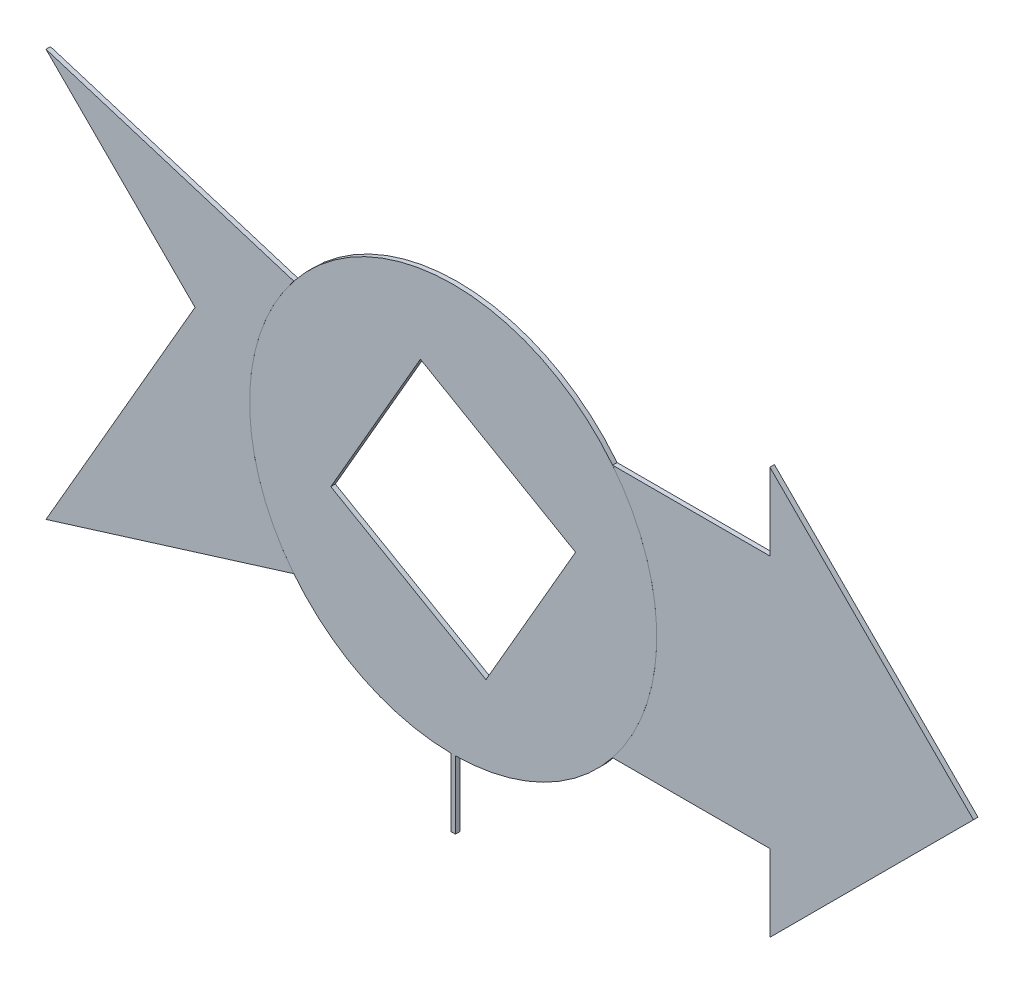
ISO-10303-21;
HEADER;
FILE_DESCRIPTION(('STEP AP214'),'2;1');
FILE_NAME('part.step','',(''),(''),'','','');
FILE_SCHEMA(('AUTOMOTIVE_DESIGN { 1 0 10303 214 1 1 1 1 }'));
ENDSEC;
DATA;
#1=APPLICATION_CONTEXT('core data for automotive mechanical design processes');
#2=APPLICATION_PROTOCOL_DEFINITION('international standard','automotive_design',2000,#1);
#3=PRODUCT_CONTEXT('',#1,'mechanical');
#4=PRODUCT('Part','Part','',(#3));
#5=PRODUCT_RELATED_PRODUCT_CATEGORY('part','',(#4));
#6=PRODUCT_DEFINITION_FORMATION('','',#4);
#7=PRODUCT_DEFINITION_CONTEXT('part definition',#1,'design');
#8=PRODUCT_DEFINITION('design','',#6,#7);
#9=PRODUCT_DEFINITION_SHAPE('','',#8);
#10=(LENGTH_UNIT() NAMED_UNIT(*) SI_UNIT(.MILLI.,.METRE.));
#11=(NAMED_UNIT(*) PLANE_ANGLE_UNIT() SI_UNIT($,.RADIAN.));
#12=(NAMED_UNIT(*) SI_UNIT($,.STERADIAN.) SOLID_ANGLE_UNIT());
#13=UNCERTAINTY_MEASURE_WITH_UNIT(LENGTH_MEASURE(1.E-05),#10,'distance_accuracy_value','');
#14=(GEOMETRIC_REPRESENTATION_CONTEXT(3) GLOBAL_UNCERTAINTY_ASSIGNED_CONTEXT((#13)) GLOBAL_UNIT_ASSIGNED_CONTEXT((#10,
#11,#12)) REPRESENTATION_CONTEXT('',''));
#15=CARTESIAN_POINT('',(0.,0.,0.));
#16=DIRECTION('',(0.,0.,1.));
#17=DIRECTION('',(1.,0.,0.));
#18=AXIS2_PLACEMENT_3D('',#15,#16,#17);
#19=CARTESIAN_POINT('',(160.,105.,1.));
#20=DIRECTION('',(0.707106781186547,0.707106781186548,0.));
#21=DIRECTION('',(-0.707106781186548,0.707106781186547,0.));
#22=AXIS2_PLACEMENT_3D('',#19,#20,#21);
#23=PLANE('',#22);
#24=DIRECTION('',(0.707106781186548,-0.707106781186547,0.));
#25=VECTOR('',#24,1.);
#26=CARTESIAN_POINT('',(160.,105.,0.));
#27=LINE('',#26,#25);
#28=CARTESIAN_POINT('',(160.,105.,0.));
#29=VERTEX_POINT('',#28);
#30=CARTESIAN_POINT('',(205.,60.,0.));
#31=VERTEX_POINT('',#30);
#32=EDGE_CURVE('E139',#29,#31,#27,.T.);
#33=ORIENTED_EDGE('',*,*,#32,.F.);
#34=DIRECTION('',(0.,0.,-1.));
#35=VECTOR('',#34,1.);
#36=CARTESIAN_POINT('',(160.,105.,1.));
#37=LINE('',#36,#35);
#38=CARTESIAN_POINT('',(160.,105.,1.));
#39=VERTEX_POINT('',#38);
#40=EDGE_CURVE('E12',#39,#29,#37,.T.);
#41=ORIENTED_EDGE('',*,*,#40,.F.);
#42=DIRECTION('',(0.707106781186548,-0.707106781186547,0.));
#43=VECTOR('',#42,1.);
#44=CARTESIAN_POINT('',(160.,105.,1.));
#45=LINE('',#44,#43);
#46=CARTESIAN_POINT('',(205.,60.,1.));
#47=VERTEX_POINT('',#46);
#48=EDGE_CURVE('E154',#39,#47,#45,.T.);
#49=ORIENTED_EDGE('',*,*,#48,.T.);
#50=DIRECTION('',(0.,0.,-1.));
#51=VECTOR('',#50,1.);
#52=CARTESIAN_POINT('',(205.,60.,1.));
#53=LINE('',#52,#51);
#54=EDGE_CURVE('E49',#47,#31,#53,.T.);
#55=ORIENTED_EDGE('',*,*,#54,.T.);
#56=EDGE_LOOP('',(#33,#41,#49,#55));
#57=FACE_BOUND('',#56,.T.);
#58=ADVANCED_FACE('F46',(#57),#23,.T.);
#59=CARTESIAN_POINT('',(160.,105.,1.));
#60=DIRECTION('',(1.,0.,0.));
#61=DIRECTION('',(0.,0.,-1.));
#62=AXIS2_PLACEMENT_3D('',#59,#60,#61);
#63=PLANE('',#62);
#64=DIRECTION('',(0.,-1.,0.));
#65=VECTOR('',#64,1.);
#66=CARTESIAN_POINT('',(160.,105.,0.));
#67=LINE('',#66,#65);
#68=CARTESIAN_POINT('',(160.,88.,0.));
#69=VERTEX_POINT('',#68);
#70=EDGE_CURVE('E88',#29,#69,#67,.T.);
#71=ORIENTED_EDGE('',*,*,#70,.T.);
#72=DIRECTION('',(0.,0.,-1.));
#73=VECTOR('',#72,1.);
#74=CARTESIAN_POINT('',(160.,88.,1.));
#75=LINE('',#74,#73);
#76=CARTESIAN_POINT('',(160.,88.,1.));
#77=VERTEX_POINT('',#76);
#78=EDGE_CURVE('E55',#77,#69,#75,.T.);
#79=ORIENTED_EDGE('',*,*,#78,.F.);
#80=DIRECTION('',(0.,-1.,0.));
#81=VECTOR('',#80,1.);
#82=CARTESIAN_POINT('',(160.,105.,1.));
#83=LINE('',#82,#81);
#84=EDGE_CURVE('E118',#39,#77,#83,.T.);
#85=ORIENTED_EDGE('',*,*,#84,.F.);
#86=ORIENTED_EDGE('',*,*,#40,.T.);
#87=EDGE_LOOP('',(#71,#79,#85,#86));
#88=FACE_BOUND('',#87,.T.);
#89=ADVANCED_FACE('F182',(#88),#63,.F.);
#90=CARTESIAN_POINT('',(160.,88.,1.));
#91=DIRECTION('',(0.,-1.,0.));
#92=DIRECTION('',(0.,0.,-1.));
#93=AXIS2_PLACEMENT_3D('',#90,#91,#92);
#94=PLANE('',#93);
#95=DIRECTION('',(-1.,0.,0.));
#96=VECTOR('',#95,1.);
#97=CARTESIAN_POINT('',(160.,88.,0.));
#98=LINE('',#97,#96);
#99=CARTESIAN_POINT('',(125.227829907617,88.,0.));
#100=VERTEX_POINT('',#99);
#101=EDGE_CURVE('E125',#69,#100,#98,.T.);
#102=ORIENTED_EDGE('',*,*,#101,.T.);
#103=DIRECTION('',(0.,0.,-1.));
#104=VECTOR('',#103,1.);
#105=CARTESIAN_POINT('',(125.227829907617,88.,1.));
#106=LINE('',#105,#104);
#107=CARTESIAN_POINT('',(125.227829907617,88.,1.));
#108=VERTEX_POINT('',#107);
#109=EDGE_CURVE('E122',#108,#100,#106,.T.);
#110=ORIENTED_EDGE('',*,*,#109,.F.);
#111=DIRECTION('',(-1.,0.,0.));
#112=VECTOR('',#111,1.);
#113=CARTESIAN_POINT('',(160.,88.,1.));
#114=LINE('',#113,#112);
#115=EDGE_CURVE('E110',#77,#108,#114,.T.);
#116=ORIENTED_EDGE('',*,*,#115,.F.);
#117=ORIENTED_EDGE('',*,*,#78,.T.);
#118=EDGE_LOOP('',(#102,#110,#116,#117));
#119=FACE_BOUND('',#118,.T.);
#120=ADVANCED_FACE('F123',(#119),#94,.F.);
#121=CARTESIAN_POINT('',(90.,60.,1.));
#122=DIRECTION('',(0.,0.,-1.));
#123=DIRECTION('',(-1.,0.,0.));
#124=AXIS2_PLACEMENT_3D('',#121,#122,#123);
#125=CYLINDRICAL_SURFACE('',#124,45.);
#126=CARTESIAN_POINT('',(90.,60.,0.));
#127=DIRECTION('',(0.,0.,1.));
#128=DIRECTION('',(1.,0.,0.));
#129=AXIS2_PLACEMENT_3D('',#126,#127,#128);
#130=CIRCLE('',#129,45.);
#131=CARTESIAN_POINT('',(125.227829907617,32.,0.));
#132=VERTEX_POINT('',#131);
#133=EDGE_CURVE('E151',#132,#100,#130,.T.);
#134=ORIENTED_EDGE('',*,*,#133,.F.);
#135=DIRECTION('',(0.,0.,-1.));
#136=VECTOR('',#135,1.);
#137=CARTESIAN_POINT('',(125.227829907617,32.,1.));
#138=LINE('',#137,#136);
#139=CARTESIAN_POINT('',(125.227829907617,32.,1.));
#140=VERTEX_POINT('',#139);
#141=EDGE_CURVE('E129',#140,#132,#138,.T.);
#142=ORIENTED_EDGE('',*,*,#141,.F.);
#143=CARTESIAN_POINT('',(90.,60.,1.));
#144=DIRECTION('',(0.,0.,1.));
#145=DIRECTION('',(1.,0.,0.));
#146=AXIS2_PLACEMENT_3D('',#143,#144,#145);
#147=CIRCLE('',#146,45.);
#148=EDGE_CURVE('E116',#140,#108,#147,.T.);
#149=ORIENTED_EDGE('',*,*,#148,.T.);
#150=ORIENTED_EDGE('',*,*,#109,.T.);
#151=EDGE_LOOP('',(#134,#142,#149,#150));
#152=FACE_BOUND('',#151,.T.);
#153=ADVANCED_FACE('F131',(#152),#125,.F.);
#154=CARTESIAN_POINT('',(160.,32.,1.));
#155=DIRECTION('',(0.,-1.,0.));
#156=DIRECTION('',(0.,0.,-1.));
#157=AXIS2_PLACEMENT_3D('',#154,#155,#156);
#158=PLANE('',#157);
#159=DIRECTION('',(-1.,0.,0.));
#160=VECTOR('',#159,1.);
#161=CARTESIAN_POINT('',(160.,32.,0.));
#162=LINE('',#161,#160);
#163=CARTESIAN_POINT('',(160.,32.,0.));
#164=VERTEX_POINT('',#163);
#165=EDGE_CURVE('E148',#164,#132,#162,.T.);
#166=ORIENTED_EDGE('',*,*,#165,.F.);
#167=DIRECTION('',(0.,0.,-1.));
#168=VECTOR('',#167,1.);
#169=CARTESIAN_POINT('',(160.,32.,1.));
#170=LINE('',#169,#168);
#171=CARTESIAN_POINT('',(160.,32.,1.));
#172=VERTEX_POINT('',#171);
#173=EDGE_CURVE('E158',#172,#164,#170,.T.);
#174=ORIENTED_EDGE('',*,*,#173,.F.);
#175=DIRECTION('',(-1.,0.,0.));
#176=VECTOR('',#175,1.);
#177=CARTESIAN_POINT('',(160.,32.,1.));
#178=LINE('',#177,#176);
#179=EDGE_CURVE('E132',#172,#140,#178,.T.);
#180=ORIENTED_EDGE('',*,*,#179,.T.);
#181=ORIENTED_EDGE('',*,*,#141,.T.);
#182=EDGE_LOOP('',(#166,#174,#180,#181));
#183=FACE_BOUND('',#182,.T.);
#184=ADVANCED_FACE('F166',(#183),#158,.T.);
#185=CARTESIAN_POINT('',(160.,15.,1.));
#186=DIRECTION('',(-1.,0.,0.));
#187=DIRECTION('',(0.,0.,1.));
#188=AXIS2_PLACEMENT_3D('',#185,#186,#187);
#189=PLANE('',#188);
#190=DIRECTION('',(0.,1.,0.));
#191=VECTOR('',#190,1.);
#192=CARTESIAN_POINT('',(160.,15.,0.));
#193=LINE('',#192,#191);
#194=CARTESIAN_POINT('',(160.,15.,0.));
#195=VERTEX_POINT('',#194);
#196=EDGE_CURVE('E145',#195,#164,#193,.T.);
#197=ORIENTED_EDGE('',*,*,#196,.F.);
#198=DIRECTION('',(0.,0.,-1.));
#199=VECTOR('',#198,1.);
#200=CARTESIAN_POINT('',(160.,15.,1.));
#201=LINE('',#200,#199);
#202=CARTESIAN_POINT('',(160.,15.,1.));
#203=VERTEX_POINT('',#202);
#204=EDGE_CURVE('E159',#203,#195,#201,.T.);
#205=ORIENTED_EDGE('',*,*,#204,.F.);
#206=DIRECTION('',(0.,1.,0.));
#207=VECTOR('',#206,1.);
#208=CARTESIAN_POINT('',(160.,15.,1.));
#209=LINE('',#208,#207);
#210=EDGE_CURVE('E134',#203,#172,#209,.T.);
#211=ORIENTED_EDGE('',*,*,#210,.T.);
#212=ORIENTED_EDGE('',*,*,#173,.T.);
#213=EDGE_LOOP('',(#197,#205,#211,#212));
#214=FACE_BOUND('',#213,.T.);
#215=ADVANCED_FACE('F170',(#214),#189,.T.);
#216=CARTESIAN_POINT('',(205.,60.,1.));
#217=DIRECTION('',(0.707106781186547,-0.707106781186548,0.));
#218=DIRECTION('',(0.707106781186548,0.707106781186547,0.));
#219=AXIS2_PLACEMENT_3D('',#216,#217,#218);
#220=PLANE('',#219);
#221=DIRECTION('',(-0.707106781186548,-0.707106781186547,0.));
#222=VECTOR('',#221,1.);
#223=CARTESIAN_POINT('',(205.,60.,0.));
#224=LINE('',#223,#222);
#225=EDGE_CURVE('E142',#31,#195,#224,.T.);
#226=ORIENTED_EDGE('',*,*,#225,.F.);
#227=ORIENTED_EDGE('',*,*,#54,.F.);
#228=DIRECTION('',(-0.707106781186548,-0.707106781186547,0.));
#229=VECTOR('',#228,1.);
#230=CARTESIAN_POINT('',(205.,60.,1.));
#231=LINE('',#230,#229);
#232=EDGE_CURVE('E171',#47,#203,#231,.T.);
#233=ORIENTED_EDGE('',*,*,#232,.T.);
#234=ORIENTED_EDGE('',*,*,#204,.T.);
#235=EDGE_LOOP('',(#226,#227,#233,#234));
#236=FACE_BOUND('',#235,.T.);
#237=ADVANCED_FACE('F161',(#236),#220,.T.);
#238=CARTESIAN_POINT('',(90.,60.,1.));
#239=DIRECTION('',(0.,0.,1.));
#240=DIRECTION('',(1.,0.,0.));
#241=AXIS2_PLACEMENT_3D('',#238,#239,#240);
#242=PLANE('',#241);
#243=ORIENTED_EDGE('',*,*,#48,.F.);
#244=ORIENTED_EDGE('',*,*,#84,.T.);
#245=ORIENTED_EDGE('',*,*,#115,.T.);
#246=ORIENTED_EDGE('',*,*,#148,.F.);
#247=ORIENTED_EDGE('',*,*,#179,.F.);
#248=ORIENTED_EDGE('',*,*,#210,.F.);
#249=ORIENTED_EDGE('',*,*,#232,.F.);
#250=EDGE_LOOP('',(#243,#244,#245,#246,#247,#248,#249));
#251=FACE_BOUND('',#250,.T.);
#252=ADVANCED_FACE('F113',(#251),#242,.T.);
#253=CARTESIAN_POINT('',(90.,60.,0.));
#254=DIRECTION('',(0.,0.,1.));
#255=DIRECTION('',(1.,0.,0.));
#256=AXIS2_PLACEMENT_3D('',#253,#254,#255);
#257=PLANE('',#256);
#258=ORIENTED_EDGE('',*,*,#32,.T.);
#259=ORIENTED_EDGE('',*,*,#225,.T.);
#260=ORIENTED_EDGE('',*,*,#196,.T.);
#261=ORIENTED_EDGE('',*,*,#165,.T.);
#262=ORIENTED_EDGE('',*,*,#133,.T.);
#263=ORIENTED_EDGE('',*,*,#101,.F.);
#264=ORIENTED_EDGE('',*,*,#70,.F.);
#265=EDGE_LOOP('',(#258,#259,#260,#261,#262,#263,#264));
#266=FACE_BOUND('',#265,.T.);
#267=ADVANCED_FACE('F163',(#266),#257,.F.);
#268=CLOSED_SHELL('',(#58,#89,#120,#153,#184,#215,#237,#252,#267));
#269=MANIFOLD_SOLID_BREP('B2',#268);
#270=CARTESIAN_POINT('',(0.,15.,1.));
#271=DIRECTION('',(0.866025403784438,-0.500000000000001,0.));
#272=DIRECTION('',(0.500000000000001,0.866025403784438,0.));
#273=AXIS2_PLACEMENT_3D('',#270,#271,#272);
#274=PLANE('',#273);
#275=DIRECTION('',(-0.500000000000001,-0.866025403784438,0.));
#276=VECTOR('',#275,1.);
#277=CARTESIAN_POINT('',(0.,15.,0.));
#278=LINE('',#277,#276);
#279=CARTESIAN_POINT('',(32.9422863405996,72.0577136594005,0.));
#280=VERTEX_POINT('',#279);
#281=CARTESIAN_POINT('',(0.,15.,0.));
#282=VERTEX_POINT('',#281);
#283=EDGE_CURVE('E331',#280,#282,#278,.T.);
#284=ORIENTED_EDGE('',*,*,#283,.T.);
#285=DIRECTION('',(0.,0.,-1.));
#286=VECTOR('',#285,1.);
#287=CARTESIAN_POINT('',(0.,15.,1.));
#288=LINE('',#287,#286);
#289=CARTESIAN_POINT('',(0.,15.,1.));
#290=VERTEX_POINT('',#289);
#291=EDGE_CURVE('E44',#290,#282,#288,.T.);
#292=ORIENTED_EDGE('',*,*,#291,.F.);
#293=DIRECTION('',(-0.500000000000001,-0.866025403784438,0.));
#294=VECTOR('',#293,1.);
#295=CARTESIAN_POINT('',(0.,15.,1.));
#296=LINE('',#295,#294);
#297=CARTESIAN_POINT('',(32.9422863405996,72.0577136594005,1.));
#298=VERTEX_POINT('',#297);
#299=EDGE_CURVE('E339',#298,#290,#296,.T.);
#300=ORIENTED_EDGE('',*,*,#299,.F.);
#301=DIRECTION('',(0.,0.,-1.));
#302=VECTOR('',#301,1.);
#303=CARTESIAN_POINT('',(32.9422863405996,72.0577136594005,1.));
#304=LINE('',#303,#302);
#305=EDGE_CURVE('E327',#298,#280,#304,.T.);
#306=ORIENTED_EDGE('',*,*,#305,.T.);
#307=EDGE_LOOP('',(#284,#292,#300,#306));
#308=FACE_BOUND('',#307,.T.);
#309=ADVANCED_FACE('F257',(#308),#274,.F.);
#310=CARTESIAN_POINT('',(0.,15.,1.));
#311=DIRECTION('',(-0.296426894481807,0.955055546147904,0.));
#312=DIRECTION('',(-0.955055546147904,-0.296426894481807,0.));
#313=AXIS2_PLACEMENT_3D('',#310,#311,#312);
#314=PLANE('',#313);
#315=DIRECTION('',(0.955055546147904,0.296426894481807,0.));
#316=VECTOR('',#315,1.);
#317=CARTESIAN_POINT('',(0.,15.,0.));
#318=LINE('',#317,#316);
#319=CARTESIAN_POINT('',(54.7721700923829,32.,0.));
#320=VERTEX_POINT('',#319);
#321=EDGE_CURVE('E334',#282,#320,#318,.T.);
#322=ORIENTED_EDGE('',*,*,#321,.T.);
#323=DIRECTION('',(0.,0.,-1.));
#324=VECTOR('',#323,1.);
#325=CARTESIAN_POINT('',(54.7721700923829,32.,1.));
#326=LINE('',#325,#324);
#327=CARTESIAN_POINT('',(54.7721700923829,32.,1.));
#328=VERTEX_POINT('',#327);
#329=EDGE_CURVE('E265',#328,#320,#326,.T.);
#330=ORIENTED_EDGE('',*,*,#329,.F.);
#331=DIRECTION('',(0.955055546147904,0.296426894481807,0.));
#332=VECTOR('',#331,1.);
#333=CARTESIAN_POINT('',(0.,15.,1.));
#334=LINE('',#333,#332);
#335=EDGE_CURVE('E307',#290,#328,#334,.T.);
#336=ORIENTED_EDGE('',*,*,#335,.F.);
#337=ORIENTED_EDGE('',*,*,#291,.T.);
#338=EDGE_LOOP('',(#322,#330,#336,#337));
#339=FACE_BOUND('',#338,.T.);
#340=ADVANCED_FACE('F358',(#339),#314,.F.);
#341=CARTESIAN_POINT('',(90.,60.,1.));
#342=DIRECTION('',(0.,0.,-1.));
#343=DIRECTION('',(-1.,0.,0.));
#344=AXIS2_PLACEMENT_3D('',#341,#342,#343);
#345=CYLINDRICAL_SURFACE('',#344,45.);
#346=CARTESIAN_POINT('',(90.,60.,0.));
#347=DIRECTION('',(0.,0.,-1.));
#348=DIRECTION('',(1.,0.,0.));
#349=AXIS2_PLACEMENT_3D('',#346,#347,#348);
#350=CIRCLE('',#349,45.);
#351=CARTESIAN_POINT('',(54.7721700923829,88.,0.));
#352=VERTEX_POINT('',#351);
#353=EDGE_CURVE('E322',#320,#352,#350,.T.);
#354=ORIENTED_EDGE('',*,*,#353,.T.);
#355=DIRECTION('',(0.,0.,-1.));
#356=VECTOR('',#355,1.);
#357=CARTESIAN_POINT('',(54.7721700923829,88.,1.));
#358=LINE('',#357,#356);
#359=CARTESIAN_POINT('',(54.7721700923829,88.,1.));
#360=VERTEX_POINT('',#359);
#361=EDGE_CURVE('E319',#360,#352,#358,.T.);
#362=ORIENTED_EDGE('',*,*,#361,.F.);
#363=CARTESIAN_POINT('',(90.,60.,1.));
#364=DIRECTION('',(0.,0.,-1.));
#365=DIRECTION('',(1.,0.,0.));
#366=AXIS2_PLACEMENT_3D('',#363,#364,#365);
#367=CIRCLE('',#366,45.);
#368=EDGE_CURVE('E311',#328,#360,#367,.T.);
#369=ORIENTED_EDGE('',*,*,#368,.F.);
#370=ORIENTED_EDGE('',*,*,#329,.T.);
#371=EDGE_LOOP('',(#354,#362,#369,#370));
#372=FACE_BOUND('',#371,.T.);
#373=ADVANCED_FACE('F320',(#372),#345,.F.);
#374=CARTESIAN_POINT('',(0.,105.,1.));
#375=DIRECTION('',(-0.296426894481807,-0.955055546147904,0.));
#376=DIRECTION('',(0.955055546147904,-0.296426894481807,0.));
#377=AXIS2_PLACEMENT_3D('',#374,#375,#376);
#378=PLANE('',#377);
#379=DIRECTION('',(-0.955055546147904,0.296426894481807,0.));
#380=VECTOR('',#379,1.);
#381=CARTESIAN_POINT('',(0.,105.,0.));
#382=LINE('',#381,#380);
#383=CARTESIAN_POINT('',(0.,105.,0.));
#384=VERTEX_POINT('',#383);
#385=EDGE_CURVE('E293',#352,#384,#382,.T.);
#386=ORIENTED_EDGE('',*,*,#385,.T.);
#387=DIRECTION('',(0.,0.,-1.));
#388=VECTOR('',#387,1.);
#389=CARTESIAN_POINT('',(0.,105.,1.));
#390=LINE('',#389,#388);
#391=CARTESIAN_POINT('',(0.,105.,1.));
#392=VERTEX_POINT('',#391);
#393=EDGE_CURVE('E323',#392,#384,#390,.T.);
#394=ORIENTED_EDGE('',*,*,#393,.F.);
#395=DIRECTION('',(-0.955055546147904,0.296426894481807,0.));
#396=VECTOR('',#395,1.);
#397=CARTESIAN_POINT('',(0.,105.,1.));
#398=LINE('',#397,#396);
#399=EDGE_CURVE('E315',#360,#392,#398,.T.);
#400=ORIENTED_EDGE('',*,*,#399,.F.);
#401=ORIENTED_EDGE('',*,*,#361,.T.);
#402=EDGE_LOOP('',(#386,#394,#400,#401));
#403=FACE_BOUND('',#402,.T.);
#404=ADVANCED_FACE('F325',(#403),#378,.F.);
#405=CARTESIAN_POINT('',(32.9422863405996,72.0577136594005,1.));
#406=DIRECTION('',(0.707106781186546,0.707106781186549,0.));
#407=DIRECTION('',(-0.707106781186549,0.707106781186546,0.));
#408=AXIS2_PLACEMENT_3D('',#405,#406,#407);
#409=PLANE('',#408);
#410=DIRECTION('',(0.707106781186549,-0.707106781186546,0.));
#411=VECTOR('',#410,1.);
#412=CARTESIAN_POINT('',(32.9422863405996,72.0577136594005,0.));
#413=LINE('',#412,#411);
#414=EDGE_CURVE('E299',#384,#280,#413,.T.);
#415=ORIENTED_EDGE('',*,*,#414,.T.);
#416=ORIENTED_EDGE('',*,*,#305,.F.);
#417=DIRECTION('',(0.707106781186549,-0.707106781186546,0.));
#418=VECTOR('',#417,1.);
#419=CARTESIAN_POINT('',(32.9422863405996,72.0577136594005,1.));
#420=LINE('',#419,#418);
#421=EDGE_CURVE('E273',#392,#298,#420,.T.);
#422=ORIENTED_EDGE('',*,*,#421,.F.);
#423=ORIENTED_EDGE('',*,*,#393,.T.);
#424=EDGE_LOOP('',(#415,#416,#422,#423));
#425=FACE_BOUND('',#424,.T.);
#426=ADVANCED_FACE('F347',(#425),#409,.F.);
#427=CARTESIAN_POINT('',(90.,60.,1.));
#428=DIRECTION('',(0.,0.,1.));
#429=DIRECTION('',(1.,0.,0.));
#430=AXIS2_PLACEMENT_3D('',#427,#428,#429);
#431=PLANE('',#430);
#432=ORIENTED_EDGE('',*,*,#299,.T.);
#433=ORIENTED_EDGE('',*,*,#335,.T.);
#434=ORIENTED_EDGE('',*,*,#368,.T.);
#435=ORIENTED_EDGE('',*,*,#399,.T.);
#436=ORIENTED_EDGE('',*,*,#421,.T.);
#437=EDGE_LOOP('',(#432,#433,#434,#435,#436));
#438=FACE_BOUND('',#437,.T.);
#439=ADVANCED_FACE('F313',(#438),#431,.T.);
#440=CARTESIAN_POINT('',(90.,60.,0.));
#441=DIRECTION('',(0.,0.,1.));
#442=DIRECTION('',(1.,0.,0.));
#443=AXIS2_PLACEMENT_3D('',#440,#441,#442);
#444=PLANE('',#443);
#445=ORIENTED_EDGE('',*,*,#283,.F.);
#446=ORIENTED_EDGE('',*,*,#414,.F.);
#447=ORIENTED_EDGE('',*,*,#385,.F.);
#448=ORIENTED_EDGE('',*,*,#353,.F.);
#449=ORIENTED_EDGE('',*,*,#321,.F.);
#450=EDGE_LOOP('',(#445,#446,#447,#448,#449));
#451=FACE_BOUND('',#450,.T.);
#452=ADVANCED_FACE('F343',(#451),#444,.F.);
#453=CLOSED_SHELL('',(#309,#340,#373,#404,#426,#439,#452));
#454=MANIFOLD_SOLID_BREP('B6',#453);
#455=CARTESIAN_POINT('',(90.,60.,1.));
#456=DIRECTION('',(0.,0.,-1.));
#457=DIRECTION('',(-1.,0.,0.));
#458=AXIS2_PLACEMENT_3D('',#455,#456,#457);
#459=CYLINDRICAL_SURFACE('',#458,45.);
#460=CARTESIAN_POINT('',(90.,60.,0.));
#461=DIRECTION('',(0.,0.,1.));
#462=DIRECTION('',(1.,0.,0.));
#463=AXIS2_PLACEMENT_3D('',#460,#461,#462);
#464=CIRCLE('',#463,45.);
#465=CARTESIAN_POINT('',(90.5,15.002777863517,0.));
#466=VERTEX_POINT('',#465);
#467=CARTESIAN_POINT('',(89.5,15.002777863517,0.));
#468=VERTEX_POINT('',#467);
#469=EDGE_CURVE('E506',#466,#468,#464,.T.);
#470=ORIENTED_EDGE('',*,*,#469,.T.);
#471=DIRECTION('',(0.,0.,-1.));
#472=VECTOR('',#471,1.);
#473=CARTESIAN_POINT('',(89.5,15.002777863517,1.));
#474=LINE('',#473,#472);
#475=CARTESIAN_POINT('',(89.5,15.002777863517,1.));
#476=VERTEX_POINT('',#475);
#477=EDGE_CURVE('E255',#476,#468,#474,.T.);
#478=ORIENTED_EDGE('',*,*,#477,.F.);
#479=CARTESIAN_POINT('',(90.,60.,1.));
#480=DIRECTION('',(0.,0.,1.));
#481=DIRECTION('',(1.,0.,0.));
#482=AXIS2_PLACEMENT_3D('',#479,#480,#481);
#483=CIRCLE('',#482,45.);
#484=CARTESIAN_POINT('',(90.5,15.002777863517,1.));
#485=VERTEX_POINT('',#484);
#486=EDGE_CURVE('E510',#485,#476,#483,.T.);
#487=ORIENTED_EDGE('',*,*,#486,.F.);
#488=DIRECTION('',(0.,0.,-1.));
#489=VECTOR('',#488,1.);
#490=CARTESIAN_POINT('',(90.5,15.002777863517,1.));
#491=LINE('',#490,#489);
#492=EDGE_CURVE('E520',#485,#466,#491,.T.);
#493=ORIENTED_EDGE('',*,*,#492,.T.);
#494=EDGE_LOOP('',(#470,#478,#487,#493));
#495=FACE_BOUND('',#494,.T.);
#496=ADVANCED_FACE('F409',(#495),#459,.T.);
#497=CARTESIAN_POINT('',(89.5,15.002777863517,1.));
#498=DIRECTION('',(1.,0.,0.));
#499=DIRECTION('',(0.,1.,0.));
#500=AXIS2_PLACEMENT_3D('',#497,#498,#499);
#501=PLANE('',#500);
#502=DIRECTION('',(0.,-1.,0.));
#503=VECTOR('',#502,1.);
#504=CARTESIAN_POINT('',(89.5,15.002777863517,0.));
#505=LINE('',#504,#503);
#506=CARTESIAN_POINT('',(89.5,0.,0.));
#507=VERTEX_POINT('',#506);
#508=EDGE_CURVE('E523',#468,#507,#505,.T.);
#509=ORIENTED_EDGE('',*,*,#508,.T.);
#510=DIRECTION('',(0.,0.,-1.));
#511=VECTOR('',#510,1.);
#512=CARTESIAN_POINT('',(89.5,0.,1.));
#513=LINE('',#512,#511);
#514=CARTESIAN_POINT('',(89.5,0.,1.));
#515=VERTEX_POINT('',#514);
#516=EDGE_CURVE('E416',#515,#507,#513,.T.);
#517=ORIENTED_EDGE('',*,*,#516,.F.);
#518=DIRECTION('',(0.,-1.,0.));
#519=VECTOR('',#518,1.);
#520=CARTESIAN_POINT('',(89.5,15.002777863517,1.));
#521=LINE('',#520,#519);
#522=EDGE_CURVE('E513',#476,#515,#521,.T.);
#523=ORIENTED_EDGE('',*,*,#522,.F.);
#524=ORIENTED_EDGE('',*,*,#477,.T.);
#525=EDGE_LOOP('',(#509,#517,#523,#524));
#526=FACE_BOUND('',#525,.T.);
#527=ADVANCED_FACE('F551',(#526),#501,.F.);
#528=CARTESIAN_POINT('',(89.5,0.,1.));
#529=DIRECTION('',(0.,1.,0.));
#530=DIRECTION('',(0.,0.,1.));
#531=AXIS2_PLACEMENT_3D('',#528,#529,#530);
#532=PLANE('',#531);
#533=DIRECTION('',(1.,0.,0.));
#534=VECTOR('',#533,1.);
#535=CARTESIAN_POINT('',(89.5,0.,0.));
#536=LINE('',#535,#534);
#537=CARTESIAN_POINT('',(90.5,0.,0.));
#538=VERTEX_POINT('',#537);
#539=EDGE_CURVE('E525',#507,#538,#536,.T.);
#540=ORIENTED_EDGE('',*,*,#539,.T.);
#541=DIRECTION('',(0.,0.,-1.));
#542=VECTOR('',#541,1.);
#543=CARTESIAN_POINT('',(90.5,0.,1.));
#544=LINE('',#543,#542);
#545=CARTESIAN_POINT('',(90.5,0.,1.));
#546=VERTEX_POINT('',#545);
#547=EDGE_CURVE('E530',#546,#538,#544,.T.);
#548=ORIENTED_EDGE('',*,*,#547,.F.);
#549=DIRECTION('',(1.,0.,0.));
#550=VECTOR('',#549,1.);
#551=CARTESIAN_POINT('',(89.5,0.,1.));
#552=LINE('',#551,#550);
#553=EDGE_CURVE('E516',#515,#546,#552,.T.);
#554=ORIENTED_EDGE('',*,*,#553,.F.);
#555=ORIENTED_EDGE('',*,*,#516,.T.);
#556=EDGE_LOOP('',(#540,#548,#554,#555));
#557=FACE_BOUND('',#556,.T.);
#558=ADVANCED_FACE('F537',(#557),#532,.F.);
#559=CARTESIAN_POINT('',(90.5,15.002777863517,1.));
#560=DIRECTION('',(-1.,0.,0.));
#561=DIRECTION('',(0.,0.,1.));
#562=AXIS2_PLACEMENT_3D('',#559,#560,#561);
#563=PLANE('',#562);
#564=DIRECTION('',(0.,1.,0.));
#565=VECTOR('',#564,1.);
#566=CARTESIAN_POINT('',(90.5,15.002777863517,0.));
#567=LINE('',#566,#565);
#568=EDGE_CURVE('E514',#538,#466,#567,.T.);
#569=ORIENTED_EDGE('',*,*,#568,.T.);
#570=ORIENTED_EDGE('',*,*,#492,.F.);
#571=DIRECTION('',(0.,1.,0.));
#572=VECTOR('',#571,1.);
#573=CARTESIAN_POINT('',(90.5,15.002777863517,1.));
#574=LINE('',#573,#572);
#575=EDGE_CURVE('E518',#546,#485,#574,.T.);
#576=ORIENTED_EDGE('',*,*,#575,.F.);
#577=ORIENTED_EDGE('',*,*,#547,.T.);
#578=EDGE_LOOP('',(#569,#570,#576,#577));
#579=FACE_BOUND('',#578,.T.);
#580=ADVANCED_FACE('F544',(#579),#563,.F.);
#581=CARTESIAN_POINT('',(90.,60.,1.));
#582=DIRECTION('',(0.,0.,1.));
#583=DIRECTION('',(1.,0.,0.));
#584=AXIS2_PLACEMENT_3D('',#581,#582,#583);
#585=PLANE('',#584);
#586=DIRECTION('',(-0.499999999999998,-0.86602540378444,0.));
#587=VECTOR('',#586,1.);
#588=CARTESIAN_POINT('',(62.9540768639061,52.7530667371293,1.));
#589=LINE('',#588,#587);
#590=CARTESIAN_POINT('',(82.7530667371294,87.0459231360939,1.));
#591=VERTEX_POINT('',#590);
#592=CARTESIAN_POINT('',(62.9540768639061,52.7530667371294,1.));
#593=VERTEX_POINT('',#592);
#594=EDGE_CURVE('E423',#591,#593,#589,.T.);
#595=ORIENTED_EDGE('',*,*,#594,.F.);
#596=DIRECTION('',(-0.86602540378444,0.499999999999998,0.));
#597=VECTOR('',#596,1.);
#598=CARTESIAN_POINT('',(82.7530667371294,87.0459231360939,1.));
#599=LINE('',#598,#597);
#600=CARTESIAN_POINT('',(117.045923136094,67.2469332628707,1.));
#601=VERTEX_POINT('',#600);
#602=EDGE_CURVE('E491',#601,#591,#599,.T.);
#603=ORIENTED_EDGE('',*,*,#602,.F.);
#604=DIRECTION('',(0.499999999999998,0.86602540378444,0.));
#605=VECTOR('',#604,1.);
#606=CARTESIAN_POINT('',(97.2469332628707,32.9540768639061,1.));
#607=LINE('',#606,#605);
#608=CARTESIAN_POINT('',(97.2469332628707,32.9540768639061,1.));
#609=VERTEX_POINT('',#608);
#610=EDGE_CURVE('E494',#609,#601,#607,.T.);
#611=ORIENTED_EDGE('',*,*,#610,.F.);
#612=DIRECTION('',(0.86602540378444,-0.499999999999998,0.));
#613=VECTOR('',#612,1.);
#614=CARTESIAN_POINT('',(62.9540768639061,52.7530667371293,1.));
#615=LINE('',#614,#613);
#616=EDGE_CURVE('E500',#593,#609,#615,.T.);
#617=ORIENTED_EDGE('',*,*,#616,.F.);
#618=EDGE_LOOP('',(#595,#603,#611,#617));
#619=FACE_BOUND('',#618,.T.);
#620=ORIENTED_EDGE('',*,*,#486,.T.);
#621=ORIENTED_EDGE('',*,*,#522,.T.);
#622=ORIENTED_EDGE('',*,*,#553,.T.);
#623=ORIENTED_EDGE('',*,*,#575,.T.);
#624=EDGE_LOOP('',(#620,#621,#622,#623));
#625=FACE_BOUND('',#624,.T.);
#626=ADVANCED_FACE('F550',(#619,#625),#585,.T.);
#627=CARTESIAN_POINT('',(90.,60.,0.));
#628=DIRECTION('',(0.,0.,1.));
#629=DIRECTION('',(1.,0.,0.));
#630=AXIS2_PLACEMENT_3D('',#627,#628,#629);
#631=PLANE('',#630);
#632=DIRECTION('',(-0.86602540378444,0.499999999999998,0.));
#633=VECTOR('',#632,1.);
#634=CARTESIAN_POINT('',(82.7530667371294,87.0459231360939,0.));
#635=LINE('',#634,#633);
#636=CARTESIAN_POINT('',(117.045923136094,67.2469332628707,0.));
#637=VERTEX_POINT('',#636);
#638=CARTESIAN_POINT('',(82.7530667371294,87.0459231360939,0.));
#639=VERTEX_POINT('',#638);
#640=EDGE_CURVE('E481',#637,#639,#635,.T.);
#641=ORIENTED_EDGE('',*,*,#640,.T.);
#642=DIRECTION('',(-0.499999999999998,-0.86602540378444,0.));
#643=VECTOR('',#642,1.);
#644=CARTESIAN_POINT('',(62.9540768639061,52.7530667371293,0.));
#645=LINE('',#644,#643);
#646=CARTESIAN_POINT('',(62.9540768639061,52.7530667371293,0.));
#647=VERTEX_POINT('',#646);
#648=EDGE_CURVE('E475',#639,#647,#645,.T.);
#649=ORIENTED_EDGE('',*,*,#648,.T.);
#650=DIRECTION('',(0.86602540378444,-0.499999999999998,0.));
#651=VECTOR('',#650,1.);
#652=CARTESIAN_POINT('',(62.9540768639061,52.7530667371293,0.));
#653=LINE('',#652,#651);
#654=CARTESIAN_POINT('',(97.2469332628707,32.9540768639061,0.));
#655=VERTEX_POINT('',#654);
#656=EDGE_CURVE('E484',#647,#655,#653,.T.);
#657=ORIENTED_EDGE('',*,*,#656,.T.);
#658=DIRECTION('',(0.499999999999998,0.86602540378444,0.));
#659=VECTOR('',#658,1.);
#660=CARTESIAN_POINT('',(97.2469332628707,32.9540768639061,0.));
#661=LINE('',#660,#659);
#662=EDGE_CURVE('E431',#655,#637,#661,.T.);
#663=ORIENTED_EDGE('',*,*,#662,.T.);
#664=EDGE_LOOP('',(#641,#649,#657,#663));
#665=FACE_BOUND('',#664,.T.);
#666=ORIENTED_EDGE('',*,*,#469,.F.);
#667=ORIENTED_EDGE('',*,*,#568,.F.);
#668=ORIENTED_EDGE('',*,*,#539,.F.);
#669=ORIENTED_EDGE('',*,*,#508,.F.);
#670=EDGE_LOOP('',(#666,#667,#668,#669));
#671=FACE_BOUND('',#670,.T.);
#672=ADVANCED_FACE('F488',(#665,#671),#631,.F.);
#673=CARTESIAN_POINT('',(62.9540768639061,52.7530667371293,0.));
#674=DIRECTION('',(-0.86602540378444,0.499999999999998,0.));
#675=DIRECTION('',(-0.499999999999998,-0.86602540378444,0.));
#676=AXIS2_PLACEMENT_3D('',#673,#674,#675);
#677=PLANE('',#676);
#678=ORIENTED_EDGE('',*,*,#594,.T.);
#679=DIRECTION('',(0.,0.,1.));
#680=VECTOR('',#679,1.);
#681=CARTESIAN_POINT('',(62.9540768639061,52.7530667371293,0.));
#682=LINE('',#681,#680);
#683=EDGE_CURVE('E471',#647,#593,#682,.T.);
#684=ORIENTED_EDGE('',*,*,#683,.F.);
#685=ORIENTED_EDGE('',*,*,#648,.F.);
#686=DIRECTION('',(0.,0.,1.));
#687=VECTOR('',#686,1.);
#688=CARTESIAN_POINT('',(82.7530667371294,87.0459231360939,0.));
#689=LINE('',#688,#687);
#690=EDGE_CURVE('E504',#639,#591,#689,.T.);
#691=ORIENTED_EDGE('',*,*,#690,.T.);
#692=EDGE_LOOP('',(#678,#684,#685,#691));
#693=FACE_BOUND('',#692,.T.);
#694=ADVANCED_FACE('F473',(#693),#677,.F.);
#695=CARTESIAN_POINT('',(82.7530667371294,87.0459231360939,0.));
#696=DIRECTION('',(0.499999999999998,0.86602540378444,0.));
#697=DIRECTION('',(-0.86602540378444,0.499999999999998,0.));
#698=AXIS2_PLACEMENT_3D('',#695,#696,#697);
#699=PLANE('',#698);
#700=ORIENTED_EDGE('',*,*,#602,.T.);
#701=ORIENTED_EDGE('',*,*,#690,.F.);
#702=ORIENTED_EDGE('',*,*,#640,.F.);
#703=DIRECTION('',(0.,0.,1.));
#704=VECTOR('',#703,1.);
#705=CARTESIAN_POINT('',(117.045923136094,67.2469332628707,0.));
#706=LINE('',#705,#704);
#707=EDGE_CURVE('E507',#637,#601,#706,.T.);
#708=ORIENTED_EDGE('',*,*,#707,.T.);
#709=EDGE_LOOP('',(#700,#701,#702,#708));
#710=FACE_BOUND('',#709,.T.);
#711=ADVANCED_FACE('F568',(#710),#699,.F.);
#712=CARTESIAN_POINT('',(97.2469332628707,32.9540768639061,0.));
#713=DIRECTION('',(0.86602540378444,-0.499999999999998,0.));
#714=DIRECTION('',(0.499999999999998,0.86602540378444,0.));
#715=AXIS2_PLACEMENT_3D('',#712,#713,#714);
#716=PLANE('',#715);
#717=ORIENTED_EDGE('',*,*,#610,.T.);
#718=ORIENTED_EDGE('',*,*,#707,.F.);
#719=ORIENTED_EDGE('',*,*,#662,.F.);
#720=DIRECTION('',(0.,0.,1.));
#721=VECTOR('',#720,1.);
#722=CARTESIAN_POINT('',(97.2469332628707,32.9540768639061,0.));
#723=LINE('',#722,#721);
#724=EDGE_CURVE('E480',#655,#609,#723,.T.);
#725=ORIENTED_EDGE('',*,*,#724,.T.);
#726=EDGE_LOOP('',(#717,#718,#719,#725));
#727=FACE_BOUND('',#726,.T.);
#728=ADVANCED_FACE('F571',(#727),#716,.F.);
#729=CARTESIAN_POINT('',(62.9540768639061,52.7530667371293,0.));
#730=DIRECTION('',(-0.499999999999998,-0.86602540378444,0.));
#731=DIRECTION('',(0.86602540378444,-0.499999999999998,0.));
#732=AXIS2_PLACEMENT_3D('',#729,#730,#731);
#733=PLANE('',#732);
#734=ORIENTED_EDGE('',*,*,#616,.T.);
#735=ORIENTED_EDGE('',*,*,#724,.F.);
#736=ORIENTED_EDGE('',*,*,#656,.F.);
#737=ORIENTED_EDGE('',*,*,#683,.T.);
#738=EDGE_LOOP('',(#734,#735,#736,#737));
#739=FACE_BOUND('',#738,.T.);
#740=ADVANCED_FACE('F485',(#739),#733,.F.);
#741=CLOSED_SHELL('',(#496,#527,#558,#580,#626,#672,#694,#711,#728,#740));
#742=MANIFOLD_SOLID_BREP('B38',#741);
#743=ADVANCED_BREP_SHAPE_REPRESENTATION('',(#18,#269,#454,#742),#14);
#744=SHAPE_DEFINITION_REPRESENTATION(#9,#743);
ENDSEC;
END-ISO-10303-21;
